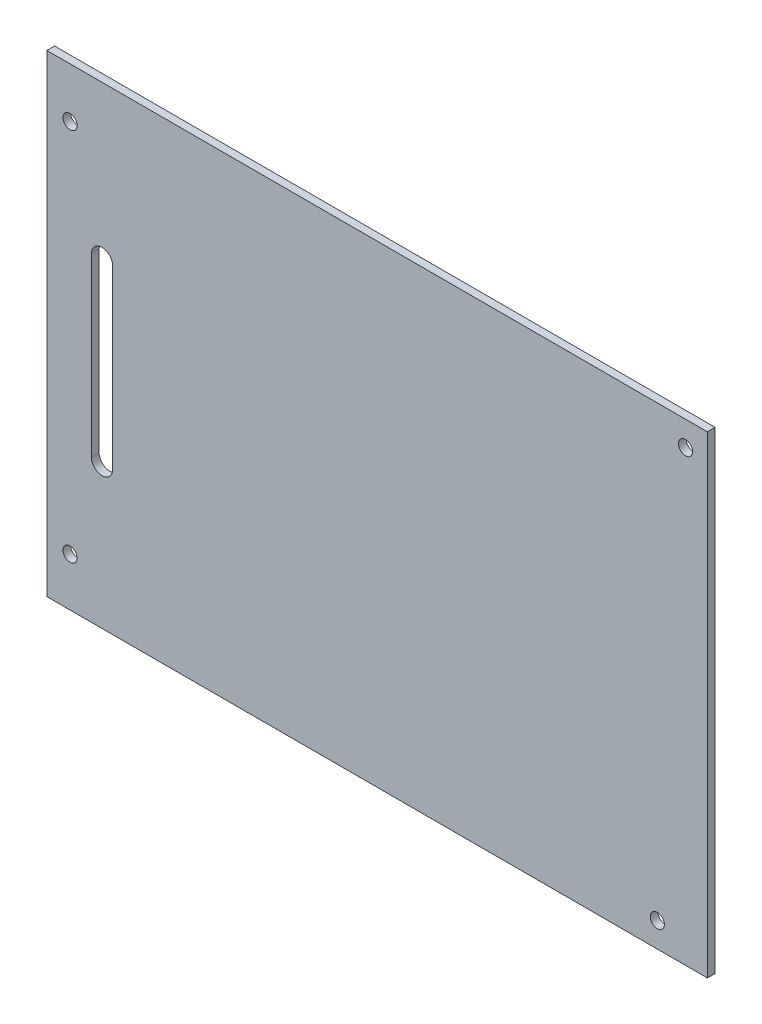
ISO-10303-21;
HEADER;
FILE_DESCRIPTION(('STEP AP214'),'2;1');
FILE_NAME('part.step','',(''),(''),'','','');
FILE_SCHEMA(('AUTOMOTIVE_DESIGN { 1 0 10303 214 1 1 1 1 }'));
ENDSEC;
DATA;
#1=APPLICATION_CONTEXT('core data for automotive mechanical design processes');
#2=APPLICATION_PROTOCOL_DEFINITION('international standard','automotive_design',2000,#1);
#3=PRODUCT_CONTEXT('',#1,'mechanical');
#4=PRODUCT('Part','Part','',(#3));
#5=PRODUCT_RELATED_PRODUCT_CATEGORY('part','',(#4));
#6=PRODUCT_DEFINITION_FORMATION('','',#4);
#7=PRODUCT_DEFINITION_CONTEXT('part definition',#1,'design');
#8=PRODUCT_DEFINITION('design','',#6,#7);
#9=PRODUCT_DEFINITION_SHAPE('','',#8);
#10=(LENGTH_UNIT() NAMED_UNIT(*) SI_UNIT(.MILLI.,.METRE.));
#11=(NAMED_UNIT(*) PLANE_ANGLE_UNIT() SI_UNIT($,.RADIAN.));
#12=(NAMED_UNIT(*) SI_UNIT($,.STERADIAN.) SOLID_ANGLE_UNIT());
#13=UNCERTAINTY_MEASURE_WITH_UNIT(LENGTH_MEASURE(1.E-05),#10,'distance_accuracy_value','');
#14=(GEOMETRIC_REPRESENTATION_CONTEXT(3) GLOBAL_UNCERTAINTY_ASSIGNED_CONTEXT((#13)) GLOBAL_UNIT_ASSIGNED_CONTEXT((#10,
#11,#12)) REPRESENTATION_CONTEXT('',''));
#15=CARTESIAN_POINT('',(0.,0.,0.));
#16=DIRECTION('',(0.,0.,1.));
#17=DIRECTION('',(1.,0.,0.));
#18=AXIS2_PLACEMENT_3D('',#15,#16,#17);
#19=CARTESIAN_POINT('',(102.6585,80.9275,1.09144054));
#20=DIRECTION('',(0.,0.,-1.));
#21=DIRECTION('',(0.,-1.,0.));
#22=AXIS2_PLACEMENT_3D('',#19,#20,#21);
#23=PLANE('',#22);
#24=CARTESIAN_POINT('',(146.336,110.928,1.09144054));
#25=DIRECTION('',(0.,0.,1.));
#26=DIRECTION('',(1.,0.,0.));
#27=AXIS2_PLACEMENT_3D('',#24,#25,#26);
#28=CIRCLE('',#27,1.);
#29=CARTESIAN_POINT('',(147.336,110.928,1.09144054));
#30=VERTEX_POINT('',#29);
#31=EDGE_CURVE('E25',#30,#30,#28,.T.);
#32=ORIENTED_EDGE('',*,*,#31,.F.);
#33=EDGE_LOOP('',(#32));
#34=FACE_BOUND('',#33,.T.);
#35=CARTESIAN_POINT('',(63.6999996,92.67500134,1.09144054));
#36=DIRECTION('',(0.,0.,1.));
#37=DIRECTION('',(1.,0.,0.));
#38=AXIS2_PLACEMENT_3D('',#35,#36,#37);
#39=CIRCLE('',#38,1.49999954);
#40=CARTESIAN_POINT('',(65.19999914,92.67500134,1.09144054));
#41=VERTEX_POINT('',#40);
#42=CARTESIAN_POINT('',(62.20000006,92.67500134,1.09144054));
#43=VERTEX_POINT('',#42);
#44=EDGE_CURVE('E179',#41,#43,#39,.T.);
#45=ORIENTED_EDGE('',*,*,#44,.F.);
#46=DIRECTION('',(0.,1.,0.));
#47=VECTOR('',#46,1.);
#48=CARTESIAN_POINT('',(65.19999914,67.67500054,1.09144054));
#49=LINE('',#48,#47);
#50=CARTESIAN_POINT('',(65.19999914,67.67500054,1.09144054));
#51=VERTEX_POINT('',#50);
#52=EDGE_CURVE('E174',#51,#41,#49,.T.);
#53=ORIENTED_EDGE('',*,*,#52,.F.);
#54=CARTESIAN_POINT('',(63.6999996,67.67500054,1.09144054));
#55=DIRECTION('',(0.,0.,1.));
#56=DIRECTION('',(-1.,0.,0.));
#57=AXIS2_PLACEMENT_3D('',#54,#55,#56);
#58=CIRCLE('',#57,1.49999954);
#59=CARTESIAN_POINT('',(62.20000006,67.67500054,1.09144054));
#60=VERTEX_POINT('',#59);
#61=EDGE_CURVE('E162',#60,#51,#58,.T.);
#62=ORIENTED_EDGE('',*,*,#61,.F.);
#63=DIRECTION('',(0.,-1.,0.));
#64=VECTOR('',#63,1.);
#65=CARTESIAN_POINT('',(62.20000006,92.67500134,1.09144054));
#66=LINE('',#65,#64);
#67=EDGE_CURVE('E148',#43,#60,#66,.T.);
#68=ORIENTED_EDGE('',*,*,#67,.F.);
#69=EDGE_LOOP('',(#45,#53,#62,#68));
#70=FACE_BOUND('',#69,.T.);
#71=CARTESIAN_POINT('',(142.336,50.928,1.09144054));
#72=DIRECTION('',(0.,0.,1.));
#73=DIRECTION('',(1.,0.,0.));
#74=AXIS2_PLACEMENT_3D('',#71,#72,#73);
#75=CIRCLE('',#74,1.);
#76=CARTESIAN_POINT('',(143.336,50.928,1.09144054));
#77=VERTEX_POINT('',#76);
#78=EDGE_CURVE('E140',#77,#77,#75,.T.);
#79=ORIENTED_EDGE('',*,*,#78,.F.);
#80=EDGE_LOOP('',(#79));
#81=FACE_BOUND('',#80,.T.);
#82=CARTESIAN_POINT('',(59.175,107.337,1.09144054));
#83=DIRECTION('',(0.,0.,1.));
#84=DIRECTION('',(1.,0.,0.));
#85=AXIS2_PLACEMENT_3D('',#82,#83,#84);
#86=CIRCLE('',#85,1.);
#87=CARTESIAN_POINT('',(60.175,107.337,1.09144054));
#88=VERTEX_POINT('',#87);
#89=EDGE_CURVE('E261',#88,#88,#86,.T.);
#90=ORIENTED_EDGE('',*,*,#89,.F.);
#91=EDGE_LOOP('',(#90));
#92=FACE_BOUND('',#91,.T.);
#93=CARTESIAN_POINT('',(59.174,54.289,1.09144054));
#94=DIRECTION('',(0.,0.,1.));
#95=DIRECTION('',(1.,0.,0.));
#96=AXIS2_PLACEMENT_3D('',#93,#94,#95);
#97=CIRCLE('',#96,1.);
#98=CARTESIAN_POINT('',(60.174,54.289,1.09144054));
#99=VERTEX_POINT('',#98);
#100=EDGE_CURVE('E233',#99,#99,#97,.T.);
#101=ORIENTED_EDGE('',*,*,#100,.F.);
#102=EDGE_LOOP('',(#101));
#103=FACE_BOUND('',#102,.T.);
#104=DIRECTION('',(-1.,0.,0.));
#105=VECTOR('',#104,1.);
#106=CARTESIAN_POINT('',(149.431,47.432,1.09144054));
#107=LINE('',#106,#105);
#108=CARTESIAN_POINT('',(149.431,47.432,1.09144054));
#109=VERTEX_POINT('',#108);
#110=CARTESIAN_POINT('',(55.886,47.432,1.09144054));
#111=VERTEX_POINT('',#110);
#112=EDGE_CURVE('E241',#109,#111,#107,.T.);
#113=ORIENTED_EDGE('',*,*,#112,.F.);
#114=DIRECTION('',(0.,-1.,0.));
#115=VECTOR('',#114,1.);
#116=CARTESIAN_POINT('',(149.431,114.423,1.09144054));
#117=LINE('',#116,#115);
#118=CARTESIAN_POINT('',(149.431,114.423,1.09144054));
#119=VERTEX_POINT('',#118);
#120=EDGE_CURVE('E222',#119,#109,#117,.T.);
#121=ORIENTED_EDGE('',*,*,#120,.F.);
#122=DIRECTION('',(1.,0.,0.));
#123=VECTOR('',#122,1.);
#124=CARTESIAN_POINT('',(55.886,114.423,1.09144054));
#125=LINE('',#124,#123);
#126=CARTESIAN_POINT('',(55.886,114.423,1.09144054));
#127=VERTEX_POINT('',#126);
#128=EDGE_CURVE('E213',#127,#119,#125,.T.);
#129=ORIENTED_EDGE('',*,*,#128,.F.);
#130=DIRECTION('',(0.,1.,0.));
#131=VECTOR('',#130,1.);
#132=CARTESIAN_POINT('',(55.886,47.432,1.09144054));
#133=LINE('',#132,#131);
#134=EDGE_CURVE('E205',#111,#127,#133,.T.);
#135=ORIENTED_EDGE('',*,*,#134,.F.);
#136=EDGE_LOOP('',(#113,#121,#129,#135));
#137=FACE_BOUND('',#136,.T.);
#138=ADVANCED_FACE('F17',(#34,#70,#81,#92,#103,#137),#23,.F.);
#139=CARTESIAN_POINT('',(102.6585,80.9275,0.));
#140=DIRECTION('',(0.,0.,-1.));
#141=DIRECTION('',(0.,-1.,0.));
#142=AXIS2_PLACEMENT_3D('',#139,#140,#141);
#143=PLANE('',#142);
#144=CARTESIAN_POINT('',(146.336,110.928,0.));
#145=DIRECTION('',(0.,0.,1.));
#146=DIRECTION('',(1.,0.,0.));
#147=AXIS2_PLACEMENT_3D('',#144,#145,#146);
#148=CIRCLE('',#147,1.);
#149=CARTESIAN_POINT('',(147.336,110.928,0.));
#150=VERTEX_POINT('',#149);
#151=EDGE_CURVE('E11',#150,#150,#148,.T.);
#152=ORIENTED_EDGE('',*,*,#151,.T.);
#153=EDGE_LOOP('',(#152));
#154=FACE_BOUND('',#153,.T.);
#155=DIRECTION('',(0.,-1.,0.));
#156=VECTOR('',#155,1.);
#157=CARTESIAN_POINT('',(62.20000006,92.67500134,0.));
#158=LINE('',#157,#156);
#159=CARTESIAN_POINT('',(62.20000006,92.67500134,0.));
#160=VERTEX_POINT('',#159);
#161=CARTESIAN_POINT('',(62.20000006,67.67500054,0.));
#162=VERTEX_POINT('',#161);
#163=EDGE_CURVE('E158',#160,#162,#158,.T.);
#164=ORIENTED_EDGE('',*,*,#163,.T.);
#165=CARTESIAN_POINT('',(63.6999996,67.67500054,0.));
#166=DIRECTION('',(0.,0.,1.));
#167=DIRECTION('',(-1.,0.,0.));
#168=AXIS2_PLACEMENT_3D('',#165,#166,#167);
#169=CIRCLE('',#168,1.49999954);
#170=CARTESIAN_POINT('',(65.19999914,67.67500054,0.));
#171=VERTEX_POINT('',#170);
#172=EDGE_CURVE('E170',#162,#171,#169,.T.);
#173=ORIENTED_EDGE('',*,*,#172,.T.);
#174=DIRECTION('',(0.,1.,0.));
#175=VECTOR('',#174,1.);
#176=CARTESIAN_POINT('',(65.19999914,67.67500054,0.));
#177=LINE('',#176,#175);
#178=CARTESIAN_POINT('',(65.19999914,92.67500134,0.));
#179=VERTEX_POINT('',#178);
#180=EDGE_CURVE('E175',#171,#179,#177,.T.);
#181=ORIENTED_EDGE('',*,*,#180,.T.);
#182=CARTESIAN_POINT('',(63.6999996,92.67500134,0.));
#183=DIRECTION('',(0.,0.,1.));
#184=DIRECTION('',(1.,0.,0.));
#185=AXIS2_PLACEMENT_3D('',#182,#183,#184);
#186=CIRCLE('',#185,1.49999954);
#187=EDGE_CURVE('E187',#179,#160,#186,.T.);
#188=ORIENTED_EDGE('',*,*,#187,.T.);
#189=EDGE_LOOP('',(#164,#173,#181,#188));
#190=FACE_BOUND('',#189,.T.);
#191=CARTESIAN_POINT('',(142.336,50.928,0.));
#192=DIRECTION('',(0.,0.,1.));
#193=DIRECTION('',(1.,0.,0.));
#194=AXIS2_PLACEMENT_3D('',#191,#192,#193);
#195=CIRCLE('',#194,1.);
#196=CARTESIAN_POINT('',(143.336,50.928,0.));
#197=VERTEX_POINT('',#196);
#198=EDGE_CURVE('E132',#197,#197,#195,.T.);
#199=ORIENTED_EDGE('',*,*,#198,.T.);
#200=EDGE_LOOP('',(#199));
#201=FACE_BOUND('',#200,.T.);
#202=CARTESIAN_POINT('',(59.175,107.337,0.));
#203=DIRECTION('',(0.,0.,1.));
#204=DIRECTION('',(1.,0.,0.));
#205=AXIS2_PLACEMENT_3D('',#202,#203,#204);
#206=CIRCLE('',#205,1.);
#207=CARTESIAN_POINT('',(60.175,107.337,0.));
#208=VERTEX_POINT('',#207);
#209=EDGE_CURVE('E264',#208,#208,#206,.T.);
#210=ORIENTED_EDGE('',*,*,#209,.T.);
#211=EDGE_LOOP('',(#210));
#212=FACE_BOUND('',#211,.T.);
#213=CARTESIAN_POINT('',(59.174,54.289,0.));
#214=DIRECTION('',(0.,0.,1.));
#215=DIRECTION('',(1.,0.,0.));
#216=AXIS2_PLACEMENT_3D('',#213,#214,#215);
#217=CIRCLE('',#216,1.);
#218=CARTESIAN_POINT('',(60.174,54.289,0.));
#219=VERTEX_POINT('',#218);
#220=EDGE_CURVE('E236',#219,#219,#217,.T.);
#221=ORIENTED_EDGE('',*,*,#220,.T.);
#222=EDGE_LOOP('',(#221));
#223=FACE_BOUND('',#222,.T.);
#224=DIRECTION('',(0.,1.,0.));
#225=VECTOR('',#224,1.);
#226=CARTESIAN_POINT('',(55.886,47.432,0.));
#227=LINE('',#226,#225);
#228=CARTESIAN_POINT('',(55.886,47.432,0.));
#229=VERTEX_POINT('',#228);
#230=CARTESIAN_POINT('',(55.886,114.423,0.));
#231=VERTEX_POINT('',#230);
#232=EDGE_CURVE('E204',#229,#231,#227,.T.);
#233=ORIENTED_EDGE('',*,*,#232,.T.);
#234=DIRECTION('',(1.,0.,0.));
#235=VECTOR('',#234,1.);
#236=CARTESIAN_POINT('',(55.886,114.423,0.));
#237=LINE('',#236,#235);
#238=CARTESIAN_POINT('',(149.431,114.423,0.));
#239=VERTEX_POINT('',#238);
#240=EDGE_CURVE('E226',#231,#239,#237,.T.);
#241=ORIENTED_EDGE('',*,*,#240,.T.);
#242=DIRECTION('',(0.,-1.,0.));
#243=VECTOR('',#242,1.);
#244=CARTESIAN_POINT('',(149.431,114.423,0.));
#245=LINE('',#244,#243);
#246=CARTESIAN_POINT('',(149.431,47.432,0.));
#247=VERTEX_POINT('',#246);
#248=EDGE_CURVE('E221',#239,#247,#245,.T.);
#249=ORIENTED_EDGE('',*,*,#248,.T.);
#250=DIRECTION('',(-1.,0.,0.));
#251=VECTOR('',#250,1.);
#252=CARTESIAN_POINT('',(149.431,47.432,0.));
#253=LINE('',#252,#251);
#254=EDGE_CURVE('E247',#247,#229,#253,.T.);
#255=ORIENTED_EDGE('',*,*,#254,.T.);
#256=EDGE_LOOP('',(#233,#241,#249,#255));
#257=FACE_BOUND('',#256,.T.);
#258=ADVANCED_FACE('F133',(#154,#190,#201,#212,#223,#257),#143,.T.);
#259=CARTESIAN_POINT('',(146.336,110.928,0.));
#260=DIRECTION('',(0.,0.,-1.));
#261=DIRECTION('',(1.,0.,0.));
#262=AXIS2_PLACEMENT_3D('',#259,#260,#261);
#263=CYLINDRICAL_SURFACE('',#262,1.);
#264=DIRECTION('',(0.,0.,1.));
#265=VECTOR('',#264,1.);
#266=CARTESIAN_POINT('',(147.336,110.928,0.));
#267=LINE('',#266,#265);
#268=EDGE_CURVE('E189',#150,#30,#267,.T.);
#269=ORIENTED_EDGE('',*,*,#268,.T.);
#270=ORIENTED_EDGE('',*,*,#31,.T.);
#271=ORIENTED_EDGE('',*,*,#268,.F.);
#272=ORIENTED_EDGE('',*,*,#151,.F.);
#273=EDGE_LOOP('',(#269,#270,#271,#272));
#274=FACE_BOUND('',#273,.T.);
#275=ADVANCED_FACE('F297',(#274),#263,.F.);
#276=CARTESIAN_POINT('',(63.6999996,92.67500134,0.));
#277=DIRECTION('',(0.,0.,-1.));
#278=DIRECTION('',(1.,0.,0.));
#279=AXIS2_PLACEMENT_3D('',#276,#277,#278);
#280=CYLINDRICAL_SURFACE('',#279,1.49999954);
#281=DIRECTION('',(0.,0.,1.));
#282=VECTOR('',#281,1.);
#283=CARTESIAN_POINT('',(65.19999914,92.67500134,0.));
#284=LINE('',#283,#282);
#285=EDGE_CURVE('E180',#179,#41,#284,.T.);
#286=ORIENTED_EDGE('',*,*,#285,.T.);
#287=ORIENTED_EDGE('',*,*,#44,.T.);
#288=DIRECTION('',(0.,0.,1.));
#289=VECTOR('',#288,1.);
#290=CARTESIAN_POINT('',(62.20000006,92.67500134,0.));
#291=LINE('',#290,#289);
#292=EDGE_CURVE('E139',#160,#43,#291,.T.);
#293=ORIENTED_EDGE('',*,*,#292,.F.);
#294=ORIENTED_EDGE('',*,*,#187,.F.);
#295=EDGE_LOOP('',(#286,#287,#293,#294));
#296=FACE_BOUND('',#295,.T.);
#297=ADVANCED_FACE('F303',(#296),#280,.F.);
#298=CARTESIAN_POINT('',(65.19999914,67.67500054,0.));
#299=DIRECTION('',(-1.,0.,0.));
#300=DIRECTION('',(0.,0.,1.));
#301=AXIS2_PLACEMENT_3D('',#298,#299,#300);
#302=PLANE('',#301);
#303=DIRECTION('',(0.,0.,1.));
#304=VECTOR('',#303,1.);
#305=CARTESIAN_POINT('',(65.19999914,67.67500054,0.));
#306=LINE('',#305,#304);
#307=EDGE_CURVE('E166',#171,#51,#306,.T.);
#308=ORIENTED_EDGE('',*,*,#307,.T.);
#309=ORIENTED_EDGE('',*,*,#52,.T.);
#310=ORIENTED_EDGE('',*,*,#285,.F.);
#311=ORIENTED_EDGE('',*,*,#180,.F.);
#312=EDGE_LOOP('',(#308,#309,#310,#311));
#313=FACE_BOUND('',#312,.T.);
#314=ADVANCED_FACE('F323',(#313),#302,.T.);
#315=CARTESIAN_POINT('',(63.6999996,67.67500054,0.));
#316=DIRECTION('',(0.,0.,-1.));
#317=DIRECTION('',(-1.,0.,0.));
#318=AXIS2_PLACEMENT_3D('',#315,#316,#317);
#319=CYLINDRICAL_SURFACE('',#318,1.49999954);
#320=DIRECTION('',(0.,0.,1.));
#321=VECTOR('',#320,1.);
#322=CARTESIAN_POINT('',(62.20000006,67.67500054,0.));
#323=LINE('',#322,#321);
#324=EDGE_CURVE('E154',#162,#60,#323,.T.);
#325=ORIENTED_EDGE('',*,*,#324,.T.);
#326=ORIENTED_EDGE('',*,*,#61,.T.);
#327=ORIENTED_EDGE('',*,*,#307,.F.);
#328=ORIENTED_EDGE('',*,*,#172,.F.);
#329=EDGE_LOOP('',(#325,#326,#327,#328));
#330=FACE_BOUND('',#329,.T.);
#331=ADVANCED_FACE('F326',(#330),#319,.F.);
#332=CARTESIAN_POINT('',(62.20000006,92.67500134,0.));
#333=DIRECTION('',(1.,0.,0.));
#334=DIRECTION('',(0.,-1.,0.));
#335=AXIS2_PLACEMENT_3D('',#332,#333,#334);
#336=PLANE('',#335);
#337=ORIENTED_EDGE('',*,*,#292,.T.);
#338=ORIENTED_EDGE('',*,*,#67,.T.);
#339=ORIENTED_EDGE('',*,*,#324,.F.);
#340=ORIENTED_EDGE('',*,*,#163,.F.);
#341=EDGE_LOOP('',(#337,#338,#339,#340));
#342=FACE_BOUND('',#341,.T.);
#343=ADVANCED_FACE('F321',(#342),#336,.T.);
#344=CARTESIAN_POINT('',(142.336,50.928,0.));
#345=DIRECTION('',(0.,0.,-1.));
#346=DIRECTION('',(1.,0.,0.));
#347=AXIS2_PLACEMENT_3D('',#344,#345,#346);
#348=CYLINDRICAL_SURFACE('',#347,1.);
#349=DIRECTION('',(0.,0.,1.));
#350=VECTOR('',#349,1.);
#351=CARTESIAN_POINT('',(143.336,50.928,0.));
#352=LINE('',#351,#350);
#353=EDGE_CURVE('E150',#197,#77,#352,.T.);
#354=ORIENTED_EDGE('',*,*,#353,.T.);
#355=ORIENTED_EDGE('',*,*,#78,.T.);
#356=ORIENTED_EDGE('',*,*,#353,.F.);
#357=ORIENTED_EDGE('',*,*,#198,.F.);
#358=EDGE_LOOP('',(#354,#355,#356,#357));
#359=FACE_BOUND('',#358,.T.);
#360=ADVANCED_FACE('F269',(#359),#348,.F.);
#361=CARTESIAN_POINT('',(59.175,107.337,0.));
#362=DIRECTION('',(0.,0.,-1.));
#363=DIRECTION('',(1.,0.,0.));
#364=AXIS2_PLACEMENT_3D('',#361,#362,#363);
#365=CYLINDRICAL_SURFACE('',#364,1.);
#366=DIRECTION('',(0.,0.,1.));
#367=VECTOR('',#366,1.);
#368=CARTESIAN_POINT('',(60.175,107.337,0.));
#369=LINE('',#368,#367);
#370=EDGE_CURVE('E257',#208,#88,#369,.T.);
#371=ORIENTED_EDGE('',*,*,#370,.T.);
#372=ORIENTED_EDGE('',*,*,#89,.T.);
#373=ORIENTED_EDGE('',*,*,#370,.F.);
#374=ORIENTED_EDGE('',*,*,#209,.F.);
#375=EDGE_LOOP('',(#371,#372,#373,#374));
#376=FACE_BOUND('',#375,.T.);
#377=ADVANCED_FACE('F309',(#376),#365,.F.);
#378=CARTESIAN_POINT('',(59.174,54.289,0.));
#379=DIRECTION('',(0.,0.,-1.));
#380=DIRECTION('',(1.,0.,0.));
#381=AXIS2_PLACEMENT_3D('',#378,#379,#380);
#382=CYLINDRICAL_SURFACE('',#381,1.);
#383=DIRECTION('',(0.,0.,1.));
#384=VECTOR('',#383,1.);
#385=CARTESIAN_POINT('',(60.174,54.289,0.));
#386=LINE('',#385,#384);
#387=EDGE_CURVE('E237',#219,#99,#386,.T.);
#388=ORIENTED_EDGE('',*,*,#387,.T.);
#389=ORIENTED_EDGE('',*,*,#100,.T.);
#390=ORIENTED_EDGE('',*,*,#387,.F.);
#391=ORIENTED_EDGE('',*,*,#220,.F.);
#392=EDGE_LOOP('',(#388,#389,#390,#391));
#393=FACE_BOUND('',#392,.T.);
#394=ADVANCED_FACE('F312',(#393),#382,.F.);
#395=CARTESIAN_POINT('',(149.431,47.432,0.));
#396=DIRECTION('',(0.,-1.,0.));
#397=DIRECTION('',(0.,0.,-1.));
#398=AXIS2_PLACEMENT_3D('',#395,#396,#397);
#399=PLANE('',#398);
#400=DIRECTION('',(0.,0.,1.));
#401=VECTOR('',#400,1.);
#402=CARTESIAN_POINT('',(149.431,47.432,0.));
#403=LINE('',#402,#401);
#404=EDGE_CURVE('E217',#247,#109,#403,.T.);
#405=ORIENTED_EDGE('',*,*,#404,.T.);
#406=ORIENTED_EDGE('',*,*,#112,.T.);
#407=DIRECTION('',(0.,0.,1.));
#408=VECTOR('',#407,1.);
#409=CARTESIAN_POINT('',(55.886,47.432,0.));
#410=LINE('',#409,#408);
#411=EDGE_CURVE('E206',#229,#111,#410,.T.);
#412=ORIENTED_EDGE('',*,*,#411,.F.);
#413=ORIENTED_EDGE('',*,*,#254,.F.);
#414=EDGE_LOOP('',(#405,#406,#412,#413));
#415=FACE_BOUND('',#414,.T.);
#416=ADVANCED_FACE('F284',(#415),#399,.T.);
#417=CARTESIAN_POINT('',(149.431,114.423,0.));
#418=DIRECTION('',(1.,0.,0.));
#419=DIRECTION('',(0.,1.,0.));
#420=AXIS2_PLACEMENT_3D('',#417,#418,#419);
#421=PLANE('',#420);
#422=DIRECTION('',(0.,0.,1.));
#423=VECTOR('',#422,1.);
#424=CARTESIAN_POINT('',(149.431,114.423,0.));
#425=LINE('',#424,#423);
#426=EDGE_CURVE('E199',#239,#119,#425,.T.);
#427=ORIENTED_EDGE('',*,*,#426,.T.);
#428=ORIENTED_EDGE('',*,*,#120,.T.);
#429=ORIENTED_EDGE('',*,*,#404,.F.);
#430=ORIENTED_EDGE('',*,*,#248,.F.);
#431=EDGE_LOOP('',(#427,#428,#429,#430));
#432=FACE_BOUND('',#431,.T.);
#433=ADVANCED_FACE('F286',(#432),#421,.T.);
#434=CARTESIAN_POINT('',(55.886,114.423,0.));
#435=DIRECTION('',(0.,1.,0.));
#436=DIRECTION('',(1.,0.,0.));
#437=AXIS2_PLACEMENT_3D('',#434,#435,#436);
#438=PLANE('',#437);
#439=DIRECTION('',(0.,0.,1.));
#440=VECTOR('',#439,1.);
#441=CARTESIAN_POINT('',(55.886,114.423,0.));
#442=LINE('',#441,#440);
#443=EDGE_CURVE('E200',#231,#127,#442,.T.);
#444=ORIENTED_EDGE('',*,*,#443,.T.);
#445=ORIENTED_EDGE('',*,*,#128,.T.);
#446=ORIENTED_EDGE('',*,*,#426,.F.);
#447=ORIENTED_EDGE('',*,*,#240,.F.);
#448=EDGE_LOOP('',(#444,#445,#446,#447));
#449=FACE_BOUND('',#448,.T.);
#450=ADVANCED_FACE('F290',(#449),#438,.T.);
#451=CARTESIAN_POINT('',(55.886,47.432,0.));
#452=DIRECTION('',(-1.,0.,0.));
#453=DIRECTION('',(0.,0.,1.));
#454=AXIS2_PLACEMENT_3D('',#451,#452,#453);
#455=PLANE('',#454);
#456=ORIENTED_EDGE('',*,*,#411,.T.);
#457=ORIENTED_EDGE('',*,*,#134,.T.);
#458=ORIENTED_EDGE('',*,*,#443,.F.);
#459=ORIENTED_EDGE('',*,*,#232,.F.);
#460=EDGE_LOOP('',(#456,#457,#458,#459));
#461=FACE_BOUND('',#460,.T.);
#462=ADVANCED_FACE('F294',(#461),#455,.T.);
#463=CLOSED_SHELL('',(#138,#258,#275,#297,#314,#331,#343,#360,#377,#394,#416,#433,#450,#462));
#464=MANIFOLD_SOLID_BREP('B1',#463);
#465=ADVANCED_BREP_SHAPE_REPRESENTATION('',(#18,#464),#14);
#466=SHAPE_DEFINITION_REPRESENTATION(#9,#465);
ENDSEC;
END-ISO-10303-21;
